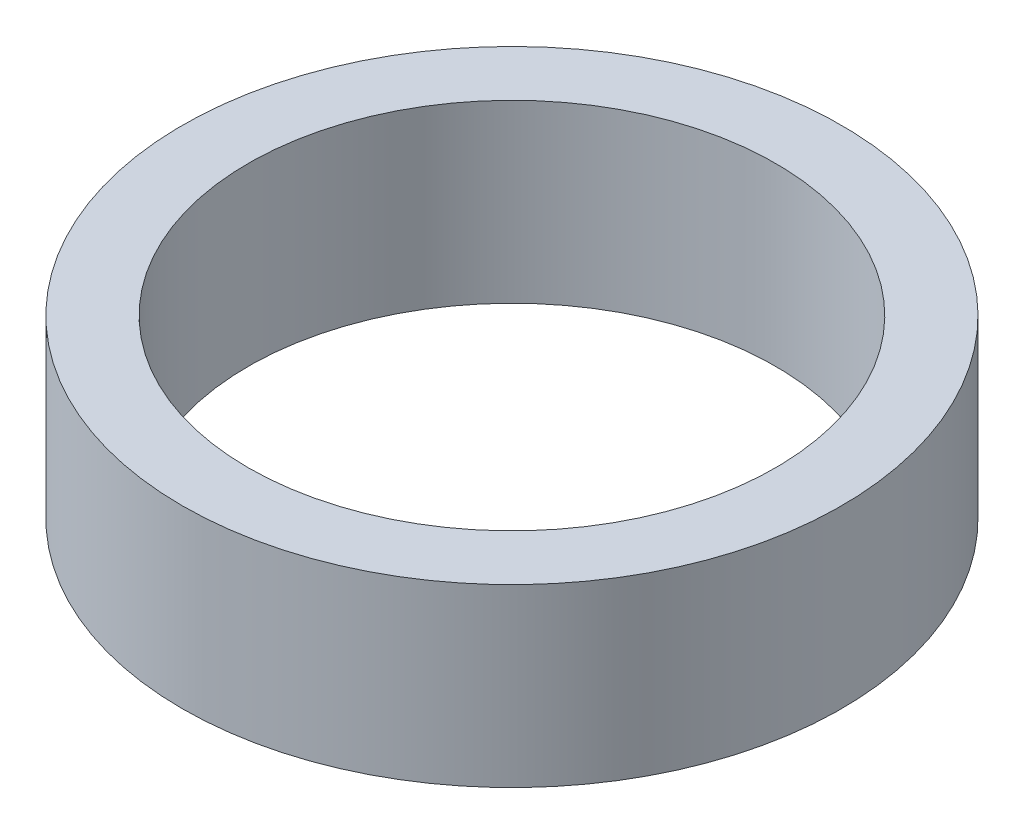
ISO-10303-21;
HEADER;
FILE_DESCRIPTION(('STEP AP214'),'2;1');
FILE_NAME('part.step','',(''),(''),'','','');
FILE_SCHEMA(('AUTOMOTIVE_DESIGN { 1 0 10303 214 1 1 1 1 }'));
ENDSEC;
DATA;
#1=APPLICATION_CONTEXT('core data for automotive mechanical design processes');
#2=APPLICATION_PROTOCOL_DEFINITION('international standard','automotive_design',2000,#1);
#3=PRODUCT_CONTEXT('',#1,'mechanical');
#4=PRODUCT('Part','Part','',(#3));
#5=PRODUCT_RELATED_PRODUCT_CATEGORY('part','',(#4));
#6=PRODUCT_DEFINITION_FORMATION('','',#4);
#7=PRODUCT_DEFINITION_CONTEXT('part definition',#1,'design');
#8=PRODUCT_DEFINITION('design','',#6,#7);
#9=PRODUCT_DEFINITION_SHAPE('','',#8);
#10=(LENGTH_UNIT() NAMED_UNIT(*) SI_UNIT(.MILLI.,.METRE.));
#11=(NAMED_UNIT(*) PLANE_ANGLE_UNIT() SI_UNIT($,.RADIAN.));
#12=(NAMED_UNIT(*) SI_UNIT($,.STERADIAN.) SOLID_ANGLE_UNIT());
#13=UNCERTAINTY_MEASURE_WITH_UNIT(LENGTH_MEASURE(1.E-05),#10,'distance_accuracy_value','');
#14=(GEOMETRIC_REPRESENTATION_CONTEXT(3) GLOBAL_UNCERTAINTY_ASSIGNED_CONTEXT((#13)) GLOBAL_UNIT_ASSIGNED_CONTEXT((#10,
#11,#12)) REPRESENTATION_CONTEXT('',''));
#15=CARTESIAN_POINT('',(0.,0.,0.));
#16=DIRECTION('',(0.,0.,1.));
#17=DIRECTION('',(1.,0.,0.));
#18=AXIS2_PLACEMENT_3D('',#15,#16,#17);
#19=CARTESIAN_POINT('',(0.,12.,0.));
#20=DIRECTION('',(0.,1.,0.));
#21=DIRECTION('',(0.,0.,1.));
#22=AXIS2_PLACEMENT_3D('',#19,#20,#21);
#23=PLANE('',#22);
#24=CARTESIAN_POINT('',(0.,12.,0.));
#25=DIRECTION('',(0.,1.,0.));
#26=DIRECTION('',(0.,0.,1.));
#27=AXIS2_PLACEMENT_3D('',#24,#25,#26);
#28=CIRCLE('',#27,22.5);
#29=CARTESIAN_POINT('',(0.,12.,22.5));
#30=VERTEX_POINT('',#29);
#31=EDGE_CURVE('E10',#30,#30,#28,.T.);
#32=ORIENTED_EDGE('',*,*,#31,.T.);
#33=EDGE_LOOP('',(#32));
#34=FACE_BOUND('',#33,.T.);
#35=CARTESIAN_POINT('',(0.,12.,0.));
#36=DIRECTION('',(0.,1.,0.));
#37=DIRECTION('',(0.,0.,1.));
#38=AXIS2_PLACEMENT_3D('',#35,#36,#37);
#39=CIRCLE('',#38,18.);
#40=CARTESIAN_POINT('',(0.,12.,18.));
#41=VERTEX_POINT('',#40);
#42=EDGE_CURVE('E50',#41,#41,#39,.T.);
#43=ORIENTED_EDGE('',*,*,#42,.F.);
#44=EDGE_LOOP('',(#43));
#45=FACE_BOUND('',#44,.T.);
#46=ADVANCED_FACE('F37',(#34,#45),#23,.T.);
#47=CARTESIAN_POINT('',(0.,0.,0.));
#48=DIRECTION('',(0.,1.,0.));
#49=DIRECTION('',(0.,0.,1.));
#50=AXIS2_PLACEMENT_3D('',#47,#48,#49);
#51=PLANE('',#50);
#52=CARTESIAN_POINT('',(0.,0.,0.));
#53=DIRECTION('',(0.,1.,0.));
#54=DIRECTION('',(0.,0.,1.));
#55=AXIS2_PLACEMENT_3D('',#52,#53,#54);
#56=CIRCLE('',#55,22.5);
#57=CARTESIAN_POINT('',(0.,0.,22.5));
#58=VERTEX_POINT('',#57);
#59=EDGE_CURVE('E41',#58,#58,#56,.T.);
#60=ORIENTED_EDGE('',*,*,#59,.F.);
#61=EDGE_LOOP('',(#60));
#62=FACE_BOUND('',#61,.T.);
#63=CARTESIAN_POINT('',(0.,0.,0.));
#64=DIRECTION('',(0.,1.,0.));
#65=DIRECTION('',(0.,0.,1.));
#66=AXIS2_PLACEMENT_3D('',#63,#64,#65);
#67=CIRCLE('',#66,18.);
#68=CARTESIAN_POINT('',(0.,0.,18.));
#69=VERTEX_POINT('',#68);
#70=EDGE_CURVE('E52',#69,#69,#67,.T.);
#71=ORIENTED_EDGE('',*,*,#70,.T.);
#72=EDGE_LOOP('',(#71));
#73=FACE_BOUND('',#72,.T.);
#74=ADVANCED_FACE('F64',(#62,#73),#51,.F.);
#75=CARTESIAN_POINT('',(0.,12.,0.));
#76=DIRECTION('',(0.,-1.,0.));
#77=DIRECTION('',(0.,0.,-1.));
#78=AXIS2_PLACEMENT_3D('',#75,#76,#77);
#79=CYLINDRICAL_SURFACE('',#78,22.5);
#80=ORIENTED_EDGE('',*,*,#31,.F.);
#81=EDGE_LOOP('',(#80));
#82=FACE_BOUND('',#81,.T.);
#83=ORIENTED_EDGE('',*,*,#59,.T.);
#84=EDGE_LOOP('',(#83));
#85=FACE_BOUND('',#84,.T.);
#86=ADVANCED_FACE('F39',(#82,#85),#79,.T.);
#87=CARTESIAN_POINT('',(0.,12.,0.));
#88=DIRECTION('',(0.,-1.,0.));
#89=DIRECTION('',(0.,0.,-1.));
#90=AXIS2_PLACEMENT_3D('',#87,#88,#89);
#91=CYLINDRICAL_SURFACE('',#90,18.);
#92=ORIENTED_EDGE('',*,*,#42,.T.);
#93=EDGE_LOOP('',(#92));
#94=FACE_BOUND('',#93,.T.);
#95=ORIENTED_EDGE('',*,*,#70,.F.);
#96=EDGE_LOOP('',(#95));
#97=FACE_BOUND('',#96,.T.);
#98=ADVANCED_FACE('F60',(#94,#97),#91,.F.);
#99=CLOSED_SHELL('',(#46,#74,#86,#98));
#100=MANIFOLD_SOLID_BREP('B2',#99);
#101=ADVANCED_BREP_SHAPE_REPRESENTATION('',(#18,#100),#14);
#102=SHAPE_DEFINITION_REPRESENTATION(#9,#101);
ENDSEC;
END-ISO-10303-21;
